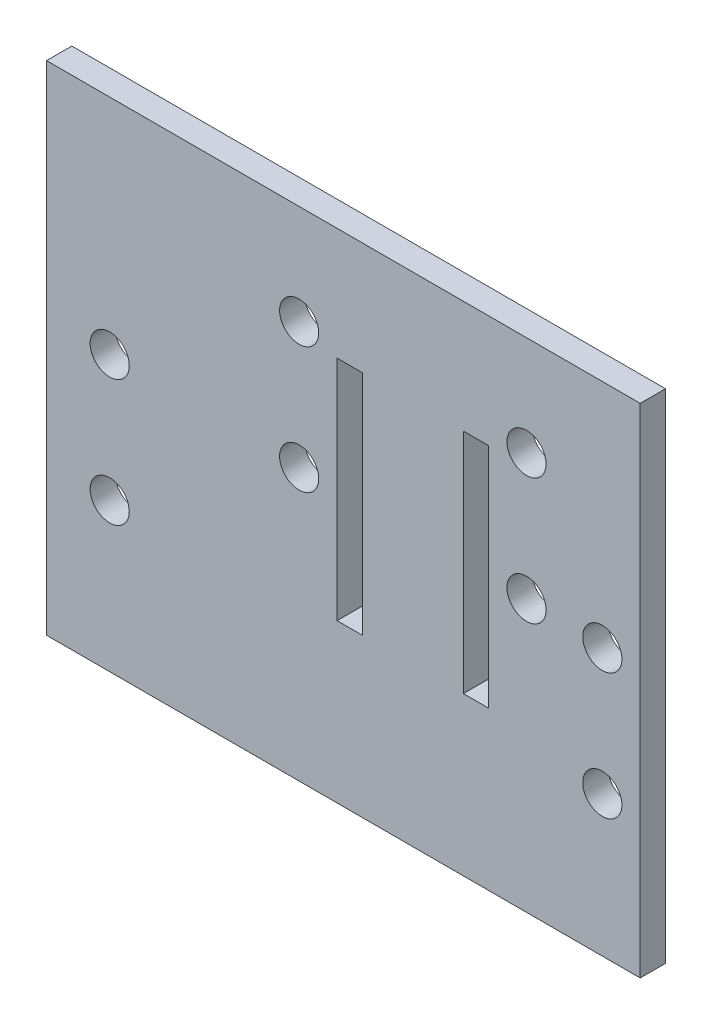
ISO-10303-21;
HEADER;
FILE_DESCRIPTION(('STEP AP214'),'2;1');
FILE_NAME('part.step','',(''),(''),'','','');
FILE_SCHEMA(('AUTOMOTIVE_DESIGN { 1 0 10303 214 1 1 1 1 }'));
ENDSEC;
DATA;
#1=APPLICATION_CONTEXT('core data for automotive mechanical design processes');
#2=APPLICATION_PROTOCOL_DEFINITION('international standard','automotive_design',2000,#1);
#3=PRODUCT_CONTEXT('',#1,'mechanical');
#4=PRODUCT('Part','Part','',(#3));
#5=PRODUCT_RELATED_PRODUCT_CATEGORY('part','',(#4));
#6=PRODUCT_DEFINITION_FORMATION('','',#4);
#7=PRODUCT_DEFINITION_CONTEXT('part definition',#1,'design');
#8=PRODUCT_DEFINITION('design','',#6,#7);
#9=PRODUCT_DEFINITION_SHAPE('','',#8);
#10=(LENGTH_UNIT() NAMED_UNIT(*) SI_UNIT(.MILLI.,.METRE.));
#11=(NAMED_UNIT(*) PLANE_ANGLE_UNIT() SI_UNIT($,.RADIAN.));
#12=(NAMED_UNIT(*) SI_UNIT($,.STERADIAN.) SOLID_ANGLE_UNIT());
#13=UNCERTAINTY_MEASURE_WITH_UNIT(LENGTH_MEASURE(1.E-05),#10,'distance_accuracy_value','');
#14=(GEOMETRIC_REPRESENTATION_CONTEXT(3) GLOBAL_UNCERTAINTY_ASSIGNED_CONTEXT((#13)) GLOBAL_UNIT_ASSIGNED_CONTEXT((#10,
#11,#12)) REPRESENTATION_CONTEXT('',''));
#15=CARTESIAN_POINT('',(0.,0.,0.));
#16=DIRECTION('',(0.,0.,1.));
#17=DIRECTION('',(1.,0.,0.));
#18=AXIS2_PLACEMENT_3D('',#15,#16,#17);
#19=CARTESIAN_POINT('',(0.,0.,2.));
#20=DIRECTION('',(0.,0.,1.));
#21=DIRECTION('',(1.,0.,0.));
#22=AXIS2_PLACEMENT_3D('',#19,#20,#21);
#23=PLANE('',#22);
#24=CARTESIAN_POINT('',(14.5,1.80000000000001,2.));
#25=DIRECTION('',(0.,0.,1.));
#26=DIRECTION('',(1.,0.,0.));
#27=AXIS2_PLACEMENT_3D('',#24,#25,#26);
#28=CIRCLE('',#27,1.55);
#29=CARTESIAN_POINT('',(16.05,1.80000000000001,2.));
#30=VERTEX_POINT('',#29);
#31=EDGE_CURVE('E380',#30,#30,#28,.T.);
#32=ORIENTED_EDGE('',*,*,#31,.F.);
#33=EDGE_LOOP('',(#32));
#34=FACE_BOUND('',#33,.T.);
#35=CARTESIAN_POINT('',(-3.49999960127017,11.8,2.));
#36=DIRECTION('',(0.,0.,1.));
#37=DIRECTION('',(1.,0.,0.));
#38=AXIS2_PLACEMENT_3D('',#35,#36,#37);
#39=CIRCLE('',#38,1.55);
#40=CARTESIAN_POINT('',(-1.94999960127017,11.8,2.));
#41=VERTEX_POINT('',#40);
#42=EDGE_CURVE('E168',#41,#41,#39,.T.);
#43=ORIENTED_EDGE('',*,*,#42,.F.);
#44=EDGE_LOOP('',(#43));
#45=FACE_BOUND('',#44,.T.);
#46=CARTESIAN_POINT('',(-18.5,2.05000000000001,2.));
#47=DIRECTION('',(0.,0.,1.));
#48=DIRECTION('',(1.,0.,0.));
#49=AXIS2_PLACEMENT_3D('',#46,#47,#48);
#50=CIRCLE('',#49,1.55);
#51=CARTESIAN_POINT('',(-16.95,2.05000000000001,2.));
#52=VERTEX_POINT('',#51);
#53=EDGE_CURVE('E235',#52,#52,#50,.T.);
#54=ORIENTED_EDGE('',*,*,#53,.F.);
#55=EDGE_LOOP('',(#54));
#56=FACE_BOUND('',#55,.T.);
#57=CARTESIAN_POINT('',(20.5,1.43,2.));
#58=DIRECTION('',(0.,0.,1.));
#59=DIRECTION('',(1.,0.,0.));
#60=AXIS2_PLACEMENT_3D('',#57,#58,#59);
#61=CIRCLE('',#60,1.55);
#62=CARTESIAN_POINT('',(22.05,1.43,2.));
#63=VERTEX_POINT('',#62);
#64=EDGE_CURVE('E251',#63,#63,#61,.T.);
#65=ORIENTED_EDGE('',*,*,#64,.F.);
#66=EDGE_LOOP('',(#65));
#67=FACE_BOUND('',#66,.T.);
#68=DIRECTION('',(0.,1.,0.));
#69=VECTOR('',#68,1.);
#70=CARTESIAN_POINT('',(23.5,19.7,2.));
#71=LINE('',#70,#69);
#72=CARTESIAN_POINT('',(23.5,-19.7,2.));
#73=VERTEX_POINT('',#72);
#74=CARTESIAN_POINT('',(23.5,19.7,2.));
#75=VERTEX_POINT('',#74);
#76=EDGE_CURVE('E259',#73,#75,#71,.T.);
#77=ORIENTED_EDGE('',*,*,#76,.T.);
#78=DIRECTION('',(-1.,0.,0.));
#79=VECTOR('',#78,1.);
#80=CARTESIAN_POINT('',(-23.5,19.7,2.));
#81=LINE('',#80,#79);
#82=CARTESIAN_POINT('',(-23.5,19.7,2.));
#83=VERTEX_POINT('',#82);
#84=EDGE_CURVE('E263',#75,#83,#81,.T.);
#85=ORIENTED_EDGE('',*,*,#84,.T.);
#86=DIRECTION('',(0.,-1.,0.));
#87=VECTOR('',#86,1.);
#88=CARTESIAN_POINT('',(-23.5,19.7,2.));
#89=LINE('',#88,#87);
#90=CARTESIAN_POINT('',(-23.5,-19.7,2.));
#91=VERTEX_POINT('',#90);
#92=EDGE_CURVE('E267',#83,#91,#89,.T.);
#93=ORIENTED_EDGE('',*,*,#92,.T.);
#94=DIRECTION('',(1.,0.,0.));
#95=VECTOR('',#94,1.);
#96=CARTESIAN_POINT('',(-23.5,-19.7,2.));
#97=LINE('',#96,#95);
#98=EDGE_CURVE('E270',#91,#73,#97,.T.);
#99=ORIENTED_EDGE('',*,*,#98,.T.);
#100=EDGE_LOOP('',(#77,#85,#93,#99));
#101=FACE_BOUND('',#100,.T.);
#102=CARTESIAN_POINT('',(20.5,-8.57,2.));
#103=DIRECTION('',(0.,0.,1.));
#104=DIRECTION('',(1.,0.,0.));
#105=AXIS2_PLACEMENT_3D('',#102,#103,#104);
#106=CIRCLE('',#105,1.55);
#107=CARTESIAN_POINT('',(22.05,-8.57,2.));
#108=VERTEX_POINT('',#107);
#109=EDGE_CURVE('E243',#108,#108,#106,.T.);
#110=ORIENTED_EDGE('',*,*,#109,.F.);
#111=EDGE_LOOP('',(#110));
#112=FACE_BOUND('',#111,.T.);
#113=CARTESIAN_POINT('',(-18.5,-7.94999999999999,2.));
#114=DIRECTION('',(0.,0.,1.));
#115=DIRECTION('',(1.,0.,0.));
#116=AXIS2_PLACEMENT_3D('',#113,#114,#115);
#117=CIRCLE('',#116,1.55);
#118=CARTESIAN_POINT('',(-16.95,-7.94999999999999,2.));
#119=VERTEX_POINT('',#118);
#120=EDGE_CURVE('E227',#119,#119,#117,.T.);
#121=ORIENTED_EDGE('',*,*,#120,.F.);
#122=EDGE_LOOP('',(#121));
#123=FACE_BOUND('',#122,.T.);
#124=DIRECTION('',(0.,-1.,0.));
#125=VECTOR('',#124,1.);
#126=CARTESIAN_POINT('',(9.49999999999999,-7.2,2.));
#127=LINE('',#126,#125);
#128=CARTESIAN_POINT('',(9.49999999999999,10.8,2.));
#129=VERTEX_POINT('',#128);
#130=CARTESIAN_POINT('',(9.49999999999999,-7.2,2.));
#131=VERTEX_POINT('',#130);
#132=EDGE_CURVE('E187',#129,#131,#127,.T.);
#133=ORIENTED_EDGE('',*,*,#132,.F.);
#134=DIRECTION('',(-1.,0.,0.));
#135=VECTOR('',#134,1.);
#136=CARTESIAN_POINT('',(9.49999999999999,10.8,2.));
#137=LINE('',#136,#135);
#138=CARTESIAN_POINT('',(11.5,10.8,2.));
#139=VERTEX_POINT('',#138);
#140=EDGE_CURVE('E184',#139,#129,#137,.T.);
#141=ORIENTED_EDGE('',*,*,#140,.F.);
#142=DIRECTION('',(0.,1.,0.));
#143=VECTOR('',#142,1.);
#144=CARTESIAN_POINT('',(11.5,10.8,2.));
#145=LINE('',#144,#143);
#146=CARTESIAN_POINT('',(11.5,-7.2,2.));
#147=VERTEX_POINT('',#146);
#148=EDGE_CURVE('E195',#147,#139,#145,.T.);
#149=ORIENTED_EDGE('',*,*,#148,.F.);
#150=DIRECTION('',(1.,0.,0.));
#151=VECTOR('',#150,1.);
#152=CARTESIAN_POINT('',(11.5,-7.2,2.));
#153=LINE('',#152,#151);
#154=EDGE_CURVE('E191',#131,#147,#153,.T.);
#155=ORIENTED_EDGE('',*,*,#154,.F.);
#156=EDGE_LOOP('',(#133,#141,#149,#155));
#157=FACE_BOUND('',#156,.T.);
#158=DIRECTION('',(0.,-1.,0.));
#159=VECTOR('',#158,1.);
#160=CARTESIAN_POINT('',(-0.500000000000014,-7.2,2.));
#161=LINE('',#160,#159);
#162=CARTESIAN_POINT('',(-0.500000000000014,10.8,2.));
#163=VERTEX_POINT('',#162);
#164=CARTESIAN_POINT('',(-0.500000000000014,-7.2,2.));
#165=VERTEX_POINT('',#164);
#166=EDGE_CURVE('E142',#163,#165,#161,.T.);
#167=ORIENTED_EDGE('',*,*,#166,.F.);
#168=DIRECTION('',(-1.,0.,0.));
#169=VECTOR('',#168,1.);
#170=CARTESIAN_POINT('',(-0.500000000000014,10.8,2.));
#171=LINE('',#170,#169);
#172=CARTESIAN_POINT('',(1.49999999999999,10.8,2.));
#173=VERTEX_POINT('',#172);
#174=EDGE_CURVE('E133',#173,#163,#171,.T.);
#175=ORIENTED_EDGE('',*,*,#174,.F.);
#176=DIRECTION('',(0.,1.,0.));
#177=VECTOR('',#176,1.);
#178=CARTESIAN_POINT('',(1.49999999999999,10.8,2.));
#179=LINE('',#178,#177);
#180=CARTESIAN_POINT('',(1.49999999999999,-7.2,2.));
#181=VERTEX_POINT('',#180);
#182=EDGE_CURVE('E160',#181,#173,#179,.T.);
#183=ORIENTED_EDGE('',*,*,#182,.F.);
#184=DIRECTION('',(1.,0.,0.));
#185=VECTOR('',#184,1.);
#186=CARTESIAN_POINT('',(1.49999999999999,-7.2,2.));
#187=LINE('',#186,#185);
#188=EDGE_CURVE('E156',#165,#181,#187,.T.);
#189=ORIENTED_EDGE('',*,*,#188,.F.);
#190=EDGE_LOOP('',(#167,#175,#183,#189));
#191=FACE_BOUND('',#190,.T.);
#192=CARTESIAN_POINT('',(-3.50000000000001,1.8,2.));
#193=DIRECTION('',(0.,0.,1.));
#194=DIRECTION('',(1.,0.,0.));
#195=AXIS2_PLACEMENT_3D('',#192,#193,#194);
#196=CIRCLE('',#195,1.55);
#197=CARTESIAN_POINT('',(-1.95000000000001,1.8,2.));
#198=VERTEX_POINT('',#197);
#199=EDGE_CURVE('E386',#198,#198,#196,.T.);
#200=ORIENTED_EDGE('',*,*,#199,.F.);
#201=EDGE_LOOP('',(#200));
#202=FACE_BOUND('',#201,.T.);
#203=CARTESIAN_POINT('',(14.5,11.8,2.));
#204=DIRECTION('',(0.,0.,1.));
#205=DIRECTION('',(1.,0.,0.));
#206=AXIS2_PLACEMENT_3D('',#203,#204,#205);
#207=CIRCLE('',#206,1.55);
#208=CARTESIAN_POINT('',(16.05,11.8,2.));
#209=VERTEX_POINT('',#208);
#210=EDGE_CURVE('E374',#209,#209,#207,.T.);
#211=ORIENTED_EDGE('',*,*,#210,.F.);
#212=EDGE_LOOP('',(#211));
#213=FACE_BOUND('',#212,.T.);
#214=ADVANCED_FACE('F43',(#34,#45,#56,#67,#101,#112,#123,#157,#191,#202,#213),#23,.T.);
#215=CARTESIAN_POINT('',(0.,0.,0.));
#216=DIRECTION('',(0.,0.,1.));
#217=DIRECTION('',(1.,0.,0.));
#218=AXIS2_PLACEMENT_3D('',#215,#216,#217);
#219=PLANE('',#218);
#220=DIRECTION('',(-1.,0.,0.));
#221=VECTOR('',#220,1.);
#222=CARTESIAN_POINT('',(9.49999999999999,10.8,0.));
#223=LINE('',#222,#221);
#224=CARTESIAN_POINT('',(11.5,10.8,0.));
#225=VERTEX_POINT('',#224);
#226=CARTESIAN_POINT('',(9.49999999999999,10.8,0.));
#227=VERTEX_POINT('',#226);
#228=EDGE_CURVE('E151',#225,#227,#223,.T.);
#229=ORIENTED_EDGE('',*,*,#228,.T.);
#230=DIRECTION('',(0.,-1.,0.));
#231=VECTOR('',#230,1.);
#232=CARTESIAN_POINT('',(9.49999999999999,-7.2,0.));
#233=LINE('',#232,#231);
#234=CARTESIAN_POINT('',(9.49999999999999,-7.2,0.));
#235=VERTEX_POINT('',#234);
#236=EDGE_CURVE('E202',#227,#235,#233,.T.);
#237=ORIENTED_EDGE('',*,*,#236,.T.);
#238=DIRECTION('',(1.,0.,0.));
#239=VECTOR('',#238,1.);
#240=CARTESIAN_POINT('',(11.5,-7.2,0.));
#241=LINE('',#240,#239);
#242=CARTESIAN_POINT('',(11.5,-7.2,0.));
#243=VERTEX_POINT('',#242);
#244=EDGE_CURVE('E206',#235,#243,#241,.T.);
#245=ORIENTED_EDGE('',*,*,#244,.T.);
#246=DIRECTION('',(0.,1.,0.));
#247=VECTOR('',#246,1.);
#248=CARTESIAN_POINT('',(11.5,10.8,0.));
#249=LINE('',#248,#247);
#250=EDGE_CURVE('E188',#243,#225,#249,.T.);
#251=ORIENTED_EDGE('',*,*,#250,.T.);
#252=EDGE_LOOP('',(#229,#237,#245,#251));
#253=FACE_BOUND('',#252,.T.);
#254=DIRECTION('',(0.,1.,0.));
#255=VECTOR('',#254,1.);
#256=CARTESIAN_POINT('',(23.5,19.7,0.));
#257=LINE('',#256,#255);
#258=CARTESIAN_POINT('',(23.5,-19.7,0.));
#259=VERTEX_POINT('',#258);
#260=CARTESIAN_POINT('',(23.5,19.7,0.));
#261=VERTEX_POINT('',#260);
#262=EDGE_CURVE('E255',#259,#261,#257,.T.);
#263=ORIENTED_EDGE('',*,*,#262,.F.);
#264=DIRECTION('',(1.,0.,0.));
#265=VECTOR('',#264,1.);
#266=CARTESIAN_POINT('',(-23.5,-19.7,0.));
#267=LINE('',#266,#265);
#268=CARTESIAN_POINT('',(-23.5,-19.7,0.));
#269=VERTEX_POINT('',#268);
#270=EDGE_CURVE('E264',#269,#259,#267,.T.);
#271=ORIENTED_EDGE('',*,*,#270,.F.);
#272=DIRECTION('',(0.,-1.,0.));
#273=VECTOR('',#272,1.);
#274=CARTESIAN_POINT('',(-23.5,19.7,0.));
#275=LINE('',#274,#273);
#276=CARTESIAN_POINT('',(-23.5,19.7,0.));
#277=VERTEX_POINT('',#276);
#278=EDGE_CURVE('E280',#277,#269,#275,.T.);
#279=ORIENTED_EDGE('',*,*,#278,.F.);
#280=DIRECTION('',(-1.,0.,0.));
#281=VECTOR('',#280,1.);
#282=CARTESIAN_POINT('',(-23.5,19.7,0.));
#283=LINE('',#282,#281);
#284=EDGE_CURVE('E277',#261,#277,#283,.T.);
#285=ORIENTED_EDGE('',*,*,#284,.F.);
#286=EDGE_LOOP('',(#263,#271,#279,#285));
#287=FACE_BOUND('',#286,.T.);
#288=CARTESIAN_POINT('',(20.5,1.43,0.));
#289=DIRECTION('',(0.,0.,1.));
#290=DIRECTION('',(1.,0.,0.));
#291=AXIS2_PLACEMENT_3D('',#288,#289,#290);
#292=CIRCLE('',#291,1.55);
#293=CARTESIAN_POINT('',(22.05,1.43,0.));
#294=VERTEX_POINT('',#293);
#295=EDGE_CURVE('E247',#294,#294,#292,.T.);
#296=ORIENTED_EDGE('',*,*,#295,.T.);
#297=EDGE_LOOP('',(#296));
#298=FACE_BOUND('',#297,.T.);
#299=CARTESIAN_POINT('',(20.5,-8.57,0.));
#300=DIRECTION('',(0.,0.,1.));
#301=DIRECTION('',(1.,0.,0.));
#302=AXIS2_PLACEMENT_3D('',#299,#300,#301);
#303=CIRCLE('',#302,1.55);
#304=CARTESIAN_POINT('',(22.05,-8.57,0.));
#305=VERTEX_POINT('',#304);
#306=EDGE_CURVE('E239',#305,#305,#303,.T.);
#307=ORIENTED_EDGE('',*,*,#306,.T.);
#308=EDGE_LOOP('',(#307));
#309=FACE_BOUND('',#308,.T.);
#310=CARTESIAN_POINT('',(-18.5,2.05000000000001,0.));
#311=DIRECTION('',(0.,0.,1.));
#312=DIRECTION('',(1.,0.,0.));
#313=AXIS2_PLACEMENT_3D('',#310,#311,#312);
#314=CIRCLE('',#313,1.55);
#315=CARTESIAN_POINT('',(-16.95,2.05000000000001,0.));
#316=VERTEX_POINT('',#315);
#317=EDGE_CURVE('E231',#316,#316,#314,.T.);
#318=ORIENTED_EDGE('',*,*,#317,.T.);
#319=EDGE_LOOP('',(#318));
#320=FACE_BOUND('',#319,.T.);
#321=CARTESIAN_POINT('',(-18.5,-7.94999999999999,0.));
#322=DIRECTION('',(0.,0.,1.));
#323=DIRECTION('',(1.,0.,0.));
#324=AXIS2_PLACEMENT_3D('',#321,#322,#323);
#325=CIRCLE('',#324,1.55);
#326=CARTESIAN_POINT('',(-16.95,-7.94999999999999,0.));
#327=VERTEX_POINT('',#326);
#328=EDGE_CURVE('E226',#327,#327,#325,.T.);
#329=ORIENTED_EDGE('',*,*,#328,.T.);
#330=EDGE_LOOP('',(#329));
#331=FACE_BOUND('',#330,.T.);
#332=DIRECTION('',(-1.,0.,0.));
#333=VECTOR('',#332,1.);
#334=CARTESIAN_POINT('',(-0.500000000000014,10.8,0.));
#335=LINE('',#334,#333);
#336=CARTESIAN_POINT('',(1.49999999999999,10.8,0.));
#337=VERTEX_POINT('',#336);
#338=CARTESIAN_POINT('',(-0.500000000000014,10.8,0.));
#339=VERTEX_POINT('',#338);
#340=EDGE_CURVE('E67',#337,#339,#335,.T.);
#341=ORIENTED_EDGE('',*,*,#340,.T.);
#342=DIRECTION('',(0.,-1.,0.));
#343=VECTOR('',#342,1.);
#344=CARTESIAN_POINT('',(-0.500000000000014,-7.2,0.));
#345=LINE('',#344,#343);
#346=CARTESIAN_POINT('',(-0.500000000000014,-7.2,0.));
#347=VERTEX_POINT('',#346);
#348=EDGE_CURVE('E149',#339,#347,#345,.T.);
#349=ORIENTED_EDGE('',*,*,#348,.T.);
#350=DIRECTION('',(1.,0.,0.));
#351=VECTOR('',#350,1.);
#352=CARTESIAN_POINT('',(1.49999999999999,-7.2,0.));
#353=LINE('',#352,#351);
#354=CARTESIAN_POINT('',(1.49999999999999,-7.2,0.));
#355=VERTEX_POINT('',#354);
#356=EDGE_CURVE('E171',#347,#355,#353,.T.);
#357=ORIENTED_EDGE('',*,*,#356,.T.);
#358=DIRECTION('',(0.,1.,0.));
#359=VECTOR('',#358,1.);
#360=CARTESIAN_POINT('',(1.49999999999999,10.8,0.));
#361=LINE('',#360,#359);
#362=EDGE_CURVE('E143',#355,#337,#361,.T.);
#363=ORIENTED_EDGE('',*,*,#362,.T.);
#364=EDGE_LOOP('',(#341,#349,#357,#363));
#365=FACE_BOUND('',#364,.T.);
#366=CARTESIAN_POINT('',(-3.49999960127017,11.8,0.));
#367=DIRECTION('',(0.,0.,1.));
#368=DIRECTION('',(1.,0.,0.));
#369=AXIS2_PLACEMENT_3D('',#366,#367,#368);
#370=CIRCLE('',#369,1.55);
#371=CARTESIAN_POINT('',(-1.94999960127017,11.8,0.));
#372=VERTEX_POINT('',#371);
#373=EDGE_CURVE('E360',#372,#372,#370,.T.);
#374=ORIENTED_EDGE('',*,*,#373,.T.);
#375=EDGE_LOOP('',(#374));
#376=FACE_BOUND('',#375,.T.);
#377=CARTESIAN_POINT('',(-3.50000000000001,1.8,0.));
#378=DIRECTION('',(0.,0.,1.));
#379=DIRECTION('',(1.,0.,0.));
#380=AXIS2_PLACEMENT_3D('',#377,#378,#379);
#381=CIRCLE('',#380,1.55);
#382=CARTESIAN_POINT('',(-1.95000000000001,1.8,0.));
#383=VERTEX_POINT('',#382);
#384=EDGE_CURVE('E364',#383,#383,#381,.T.);
#385=ORIENTED_EDGE('',*,*,#384,.T.);
#386=EDGE_LOOP('',(#385));
#387=FACE_BOUND('',#386,.T.);
#388=CARTESIAN_POINT('',(14.5,1.80000000000001,0.));
#389=DIRECTION('',(0.,0.,1.));
#390=DIRECTION('',(1.,0.,0.));
#391=AXIS2_PLACEMENT_3D('',#388,#389,#390);
#392=CIRCLE('',#391,1.55);
#393=CARTESIAN_POINT('',(16.05,1.80000000000001,0.));
#394=VERTEX_POINT('',#393);
#395=EDGE_CURVE('E368',#394,#394,#392,.T.);
#396=ORIENTED_EDGE('',*,*,#395,.T.);
#397=EDGE_LOOP('',(#396));
#398=FACE_BOUND('',#397,.T.);
#399=CARTESIAN_POINT('',(14.5,11.8,0.));
#400=DIRECTION('',(0.,0.,1.));
#401=DIRECTION('',(1.,0.,0.));
#402=AXIS2_PLACEMENT_3D('',#399,#400,#401);
#403=CIRCLE('',#402,1.55);
#404=CARTESIAN_POINT('',(16.05,11.8,0.));
#405=VERTEX_POINT('',#404);
#406=EDGE_CURVE('E371',#405,#405,#403,.T.);
#407=ORIENTED_EDGE('',*,*,#406,.T.);
#408=EDGE_LOOP('',(#407));
#409=FACE_BOUND('',#408,.T.);
#410=ADVANCED_FACE('F303',(#253,#287,#298,#309,#320,#331,#365,#376,#387,#398,#409),#219,.F.);
#411=CARTESIAN_POINT('',(23.5,19.7,2.));
#412=DIRECTION('',(-1.,0.,0.));
#413=DIRECTION('',(0.,-1.,0.));
#414=AXIS2_PLACEMENT_3D('',#411,#412,#413);
#415=PLANE('',#414);
#416=ORIENTED_EDGE('',*,*,#262,.T.);
#417=DIRECTION('',(0.,0.,-1.));
#418=VECTOR('',#417,1.);
#419=CARTESIAN_POINT('',(23.5,19.7,2.));
#420=LINE('',#419,#418);
#421=EDGE_CURVE('E11',#75,#261,#420,.T.);
#422=ORIENTED_EDGE('',*,*,#421,.F.);
#423=ORIENTED_EDGE('',*,*,#76,.F.);
#424=DIRECTION('',(0.,0.,-1.));
#425=VECTOR('',#424,1.);
#426=CARTESIAN_POINT('',(23.5,-19.7,2.));
#427=LINE('',#426,#425);
#428=EDGE_CURVE('E273',#73,#259,#427,.T.);
#429=ORIENTED_EDGE('',*,*,#428,.T.);
#430=EDGE_LOOP('',(#416,#422,#423,#429));
#431=FACE_BOUND('',#430,.T.);
#432=ADVANCED_FACE('F45',(#431),#415,.F.);
#433=CARTESIAN_POINT('',(-23.5,19.7,2.));
#434=DIRECTION('',(0.,-1.,0.));
#435=DIRECTION('',(0.,0.,-1.));
#436=AXIS2_PLACEMENT_3D('',#433,#434,#435);
#437=PLANE('',#436);
#438=ORIENTED_EDGE('',*,*,#284,.T.);
#439=DIRECTION('',(0.,0.,-1.));
#440=VECTOR('',#439,1.);
#441=CARTESIAN_POINT('',(-23.5,19.7,2.));
#442=LINE('',#441,#440);
#443=EDGE_CURVE('E52',#83,#277,#442,.T.);
#444=ORIENTED_EDGE('',*,*,#443,.F.);
#445=ORIENTED_EDGE('',*,*,#84,.F.);
#446=ORIENTED_EDGE('',*,*,#421,.T.);
#447=EDGE_LOOP('',(#438,#444,#445,#446));
#448=FACE_BOUND('',#447,.T.);
#449=ADVANCED_FACE('F314',(#448),#437,.F.);
#450=CARTESIAN_POINT('',(-23.5,19.7,2.));
#451=DIRECTION('',(1.,0.,0.));
#452=DIRECTION('',(0.,1.,0.));
#453=AXIS2_PLACEMENT_3D('',#450,#451,#452);
#454=PLANE('',#453);
#455=ORIENTED_EDGE('',*,*,#278,.T.);
#456=DIRECTION('',(0.,0.,-1.));
#457=VECTOR('',#456,1.);
#458=CARTESIAN_POINT('',(-23.5,-19.7,2.));
#459=LINE('',#458,#457);
#460=EDGE_CURVE('E288',#91,#269,#459,.T.);
#461=ORIENTED_EDGE('',*,*,#460,.F.);
#462=ORIENTED_EDGE('',*,*,#92,.F.);
#463=ORIENTED_EDGE('',*,*,#443,.T.);
#464=EDGE_LOOP('',(#455,#461,#462,#463));
#465=FACE_BOUND('',#464,.T.);
#466=ADVANCED_FACE('F297',(#465),#454,.F.);
#467=CARTESIAN_POINT('',(-23.5,-19.7,2.));
#468=DIRECTION('',(0.,1.,0.));
#469=DIRECTION('',(0.,0.,1.));
#470=AXIS2_PLACEMENT_3D('',#467,#468,#469);
#471=PLANE('',#470);
#472=ORIENTED_EDGE('',*,*,#270,.T.);
#473=ORIENTED_EDGE('',*,*,#428,.F.);
#474=ORIENTED_EDGE('',*,*,#98,.F.);
#475=ORIENTED_EDGE('',*,*,#460,.T.);
#476=EDGE_LOOP('',(#472,#473,#474,#475));
#477=FACE_BOUND('',#476,.T.);
#478=ADVANCED_FACE('F307',(#477),#471,.F.);
#479=CARTESIAN_POINT('',(20.5,1.43,2.));
#480=DIRECTION('',(0.,0.,-1.));
#481=DIRECTION('',(-1.,0.,0.));
#482=AXIS2_PLACEMENT_3D('',#479,#480,#481);
#483=CYLINDRICAL_SURFACE('',#482,1.55);
#484=ORIENTED_EDGE('',*,*,#64,.T.);
#485=EDGE_LOOP('',(#484));
#486=FACE_BOUND('',#485,.T.);
#487=ORIENTED_EDGE('',*,*,#295,.F.);
#488=EDGE_LOOP('',(#487));
#489=FACE_BOUND('',#488,.T.);
#490=ADVANCED_FACE('F332',(#486,#489),#483,.F.);
#491=CARTESIAN_POINT('',(20.5,-8.57,2.));
#492=DIRECTION('',(0.,0.,-1.));
#493=DIRECTION('',(-1.,0.,0.));
#494=AXIS2_PLACEMENT_3D('',#491,#492,#493);
#495=CYLINDRICAL_SURFACE('',#494,1.55);
#496=ORIENTED_EDGE('',*,*,#109,.T.);
#497=EDGE_LOOP('',(#496));
#498=FACE_BOUND('',#497,.T.);
#499=ORIENTED_EDGE('',*,*,#306,.F.);
#500=EDGE_LOOP('',(#499));
#501=FACE_BOUND('',#500,.T.);
#502=ADVANCED_FACE('F339',(#498,#501),#495,.F.);
#503=CARTESIAN_POINT('',(-18.5,2.05000000000001,2.));
#504=DIRECTION('',(0.,0.,-1.));
#505=DIRECTION('',(-1.,0.,0.));
#506=AXIS2_PLACEMENT_3D('',#503,#504,#505);
#507=CYLINDRICAL_SURFACE('',#506,1.55);
#508=ORIENTED_EDGE('',*,*,#53,.T.);
#509=EDGE_LOOP('',(#508));
#510=FACE_BOUND('',#509,.T.);
#511=ORIENTED_EDGE('',*,*,#317,.F.);
#512=EDGE_LOOP('',(#511));
#513=FACE_BOUND('',#512,.T.);
#514=ADVANCED_FACE('F344',(#510,#513),#507,.F.);
#515=CARTESIAN_POINT('',(-18.5,-7.94999999999999,2.));
#516=DIRECTION('',(0.,0.,-1.));
#517=DIRECTION('',(-1.,0.,0.));
#518=AXIS2_PLACEMENT_3D('',#515,#516,#517);
#519=CYLINDRICAL_SURFACE('',#518,1.55);
#520=ORIENTED_EDGE('',*,*,#120,.T.);
#521=EDGE_LOOP('',(#520));
#522=FACE_BOUND('',#521,.T.);
#523=ORIENTED_EDGE('',*,*,#328,.F.);
#524=EDGE_LOOP('',(#523));
#525=FACE_BOUND('',#524,.T.);
#526=ADVANCED_FACE('F405',(#522,#525),#519,.F.);
#527=CARTESIAN_POINT('',(9.49999999999999,10.8,2.));
#528=DIRECTION('',(0.,-1.,0.));
#529=DIRECTION('',(1.,0.,0.));
#530=AXIS2_PLACEMENT_3D('',#527,#528,#529);
#531=PLANE('',#530);
#532=ORIENTED_EDGE('',*,*,#228,.F.);
#533=DIRECTION('',(0.,0.,-1.));
#534=VECTOR('',#533,1.);
#535=CARTESIAN_POINT('',(11.5,10.8,2.));
#536=LINE('',#535,#534);
#537=EDGE_CURVE('E198',#139,#225,#536,.T.);
#538=ORIENTED_EDGE('',*,*,#537,.F.);
#539=ORIENTED_EDGE('',*,*,#140,.T.);
#540=DIRECTION('',(0.,0.,-1.));
#541=VECTOR('',#540,1.);
#542=CARTESIAN_POINT('',(9.49999999999999,10.8,2.));
#543=LINE('',#542,#541);
#544=EDGE_CURVE('E222',#129,#227,#543,.T.);
#545=ORIENTED_EDGE('',*,*,#544,.T.);
#546=EDGE_LOOP('',(#532,#538,#539,#545));
#547=FACE_BOUND('',#546,.T.);
#548=ADVANCED_FACE('F410',(#547),#531,.T.);
#549=CARTESIAN_POINT('',(9.49999999999999,-7.2,2.));
#550=DIRECTION('',(1.,0.,0.));
#551=DIRECTION('',(0.,1.,0.));
#552=AXIS2_PLACEMENT_3D('',#549,#550,#551);
#553=PLANE('',#552);
#554=ORIENTED_EDGE('',*,*,#236,.F.);
#555=ORIENTED_EDGE('',*,*,#544,.F.);
#556=ORIENTED_EDGE('',*,*,#132,.T.);
#557=DIRECTION('',(0.,0.,-1.));
#558=VECTOR('',#557,1.);
#559=CARTESIAN_POINT('',(9.49999999999999,-7.2,2.));
#560=LINE('',#559,#558);
#561=EDGE_CURVE('E219',#131,#235,#560,.T.);
#562=ORIENTED_EDGE('',*,*,#561,.T.);
#563=EDGE_LOOP('',(#554,#555,#556,#562));
#564=FACE_BOUND('',#563,.T.);
#565=ADVANCED_FACE('F416',(#564),#553,.T.);
#566=CARTESIAN_POINT('',(11.5,-7.2,2.));
#567=DIRECTION('',(0.,1.,0.));
#568=DIRECTION('',(0.,0.,1.));
#569=AXIS2_PLACEMENT_3D('',#566,#567,#568);
#570=PLANE('',#569);
#571=ORIENTED_EDGE('',*,*,#244,.F.);
#572=ORIENTED_EDGE('',*,*,#561,.F.);
#573=ORIENTED_EDGE('',*,*,#154,.T.);
#574=DIRECTION('',(0.,0.,-1.));
#575=VECTOR('',#574,1.);
#576=CARTESIAN_POINT('',(11.5,-7.2,2.));
#577=LINE('',#576,#575);
#578=EDGE_CURVE('E216',#147,#243,#577,.T.);
#579=ORIENTED_EDGE('',*,*,#578,.T.);
#580=EDGE_LOOP('',(#571,#572,#573,#579));
#581=FACE_BOUND('',#580,.T.);
#582=ADVANCED_FACE('F420',(#581),#570,.T.);
#583=CARTESIAN_POINT('',(11.5,10.8,2.));
#584=DIRECTION('',(-1.,0.,0.));
#585=DIRECTION('',(0.,-1.,0.));
#586=AXIS2_PLACEMENT_3D('',#583,#584,#585);
#587=PLANE('',#586);
#588=ORIENTED_EDGE('',*,*,#250,.F.);
#589=ORIENTED_EDGE('',*,*,#578,.F.);
#590=ORIENTED_EDGE('',*,*,#148,.T.);
#591=ORIENTED_EDGE('',*,*,#537,.T.);
#592=EDGE_LOOP('',(#588,#589,#590,#591));
#593=FACE_BOUND('',#592,.T.);
#594=ADVANCED_FACE('F424',(#593),#587,.T.);
#595=CARTESIAN_POINT('',(-0.500000000000014,10.8,2.));
#596=DIRECTION('',(0.,-1.,0.));
#597=DIRECTION('',(0.,0.,-1.));
#598=AXIS2_PLACEMENT_3D('',#595,#596,#597);
#599=PLANE('',#598);
#600=ORIENTED_EDGE('',*,*,#340,.F.);
#601=DIRECTION('',(0.,0.,-1.));
#602=VECTOR('',#601,1.);
#603=CARTESIAN_POINT('',(1.49999999999999,10.8,2.));
#604=LINE('',#603,#602);
#605=EDGE_CURVE('E137',#173,#337,#604,.T.);
#606=ORIENTED_EDGE('',*,*,#605,.F.);
#607=ORIENTED_EDGE('',*,*,#174,.T.);
#608=DIRECTION('',(0.,0.,-1.));
#609=VECTOR('',#608,1.);
#610=CARTESIAN_POINT('',(-0.500000000000014,10.8,2.));
#611=LINE('',#610,#609);
#612=EDGE_CURVE('E136',#163,#339,#611,.T.);
#613=ORIENTED_EDGE('',*,*,#612,.T.);
#614=EDGE_LOOP('',(#600,#606,#607,#613));
#615=FACE_BOUND('',#614,.T.);
#616=ADVANCED_FACE('F135',(#615),#599,.T.);
#617=CARTESIAN_POINT('',(-0.500000000000014,-7.2,2.));
#618=DIRECTION('',(1.,0.,0.));
#619=DIRECTION('',(0.,0.,-1.));
#620=AXIS2_PLACEMENT_3D('',#617,#618,#619);
#621=PLANE('',#620);
#622=ORIENTED_EDGE('',*,*,#348,.F.);
#623=ORIENTED_EDGE('',*,*,#612,.F.);
#624=ORIENTED_EDGE('',*,*,#166,.T.);
#625=DIRECTION('',(0.,0.,-1.));
#626=VECTOR('',#625,1.);
#627=CARTESIAN_POINT('',(-0.500000000000014,-7.2,2.));
#628=LINE('',#627,#626);
#629=EDGE_CURVE('E152',#165,#347,#628,.T.);
#630=ORIENTED_EDGE('',*,*,#629,.T.);
#631=EDGE_LOOP('',(#622,#623,#624,#630));
#632=FACE_BOUND('',#631,.T.);
#633=ADVANCED_FACE('F146',(#632),#621,.T.);
#634=CARTESIAN_POINT('',(1.49999999999999,-7.2,2.));
#635=DIRECTION('',(0.,1.,0.));
#636=DIRECTION('',(0.,0.,1.));
#637=AXIS2_PLACEMENT_3D('',#634,#635,#636);
#638=PLANE('',#637);
#639=ORIENTED_EDGE('',*,*,#356,.F.);
#640=ORIENTED_EDGE('',*,*,#629,.F.);
#641=ORIENTED_EDGE('',*,*,#188,.T.);
#642=DIRECTION('',(0.,0.,-1.));
#643=VECTOR('',#642,1.);
#644=CARTESIAN_POINT('',(1.49999999999999,-7.2,2.));
#645=LINE('',#644,#643);
#646=EDGE_CURVE('E59',#181,#355,#645,.T.);
#647=ORIENTED_EDGE('',*,*,#646,.T.);
#648=EDGE_LOOP('',(#639,#640,#641,#647));
#649=FACE_BOUND('',#648,.T.);
#650=ADVANCED_FACE('F433',(#649),#638,.T.);
#651=CARTESIAN_POINT('',(1.49999999999999,10.8,2.));
#652=DIRECTION('',(-1.,0.,0.));
#653=DIRECTION('',(0.,-1.,0.));
#654=AXIS2_PLACEMENT_3D('',#651,#652,#653);
#655=PLANE('',#654);
#656=ORIENTED_EDGE('',*,*,#362,.F.);
#657=ORIENTED_EDGE('',*,*,#646,.F.);
#658=ORIENTED_EDGE('',*,*,#182,.T.);
#659=ORIENTED_EDGE('',*,*,#605,.T.);
#660=EDGE_LOOP('',(#656,#657,#658,#659));
#661=FACE_BOUND('',#660,.T.);
#662=ADVANCED_FACE('F436',(#661),#655,.T.);
#663=CARTESIAN_POINT('',(-3.49999960127017,11.8,2.));
#664=DIRECTION('',(0.,0.,-1.));
#665=DIRECTION('',(-1.,0.,0.));
#666=AXIS2_PLACEMENT_3D('',#663,#664,#665);
#667=CYLINDRICAL_SURFACE('',#666,1.55);
#668=ORIENTED_EDGE('',*,*,#42,.T.);
#669=EDGE_LOOP('',(#668));
#670=FACE_BOUND('',#669,.T.);
#671=ORIENTED_EDGE('',*,*,#373,.F.);
#672=EDGE_LOOP('',(#671));
#673=FACE_BOUND('',#672,.T.);
#674=ADVANCED_FACE('F397',(#670,#673),#667,.F.);
#675=CARTESIAN_POINT('',(-3.50000000000001,1.8,2.));
#676=DIRECTION('',(0.,0.,-1.));
#677=DIRECTION('',(-1.,0.,0.));
#678=AXIS2_PLACEMENT_3D('',#675,#676,#677);
#679=CYLINDRICAL_SURFACE('',#678,1.55);
#680=ORIENTED_EDGE('',*,*,#199,.T.);
#681=EDGE_LOOP('',(#680));
#682=FACE_BOUND('',#681,.T.);
#683=ORIENTED_EDGE('',*,*,#384,.F.);
#684=EDGE_LOOP('',(#683));
#685=FACE_BOUND('',#684,.T.);
#686=ADVANCED_FACE('F442',(#682,#685),#679,.F.);
#687=CARTESIAN_POINT('',(14.5,1.80000000000001,2.));
#688=DIRECTION('',(0.,0.,-1.));
#689=DIRECTION('',(-1.,0.,0.));
#690=AXIS2_PLACEMENT_3D('',#687,#688,#689);
#691=CYLINDRICAL_SURFACE('',#690,1.55);
#692=ORIENTED_EDGE('',*,*,#31,.T.);
#693=EDGE_LOOP('',(#692));
#694=FACE_BOUND('',#693,.T.);
#695=ORIENTED_EDGE('',*,*,#395,.F.);
#696=EDGE_LOOP('',(#695));
#697=FACE_BOUND('',#696,.T.);
#698=ADVANCED_FACE('F445',(#694,#697),#691,.F.);
#699=CARTESIAN_POINT('',(14.5,11.8,2.));
#700=DIRECTION('',(0.,0.,-1.));
#701=DIRECTION('',(-1.,0.,0.));
#702=AXIS2_PLACEMENT_3D('',#699,#700,#701);
#703=CYLINDRICAL_SURFACE('',#702,1.55);
#704=ORIENTED_EDGE('',*,*,#210,.T.);
#705=EDGE_LOOP('',(#704));
#706=FACE_BOUND('',#705,.T.);
#707=ORIENTED_EDGE('',*,*,#406,.F.);
#708=EDGE_LOOP('',(#707));
#709=FACE_BOUND('',#708,.T.);
#710=ADVANCED_FACE('F449',(#706,#709),#703,.F.);
#711=CLOSED_SHELL('',(#214,#410,#432,#449,#466,#478,#490,#502,#514,#526,#548,#565,#582,#594,
#616,#633,#650,#662,#674,#686,#698,#710));
#712=MANIFOLD_SOLID_BREP('B2',#711);
#713=ADVANCED_BREP_SHAPE_REPRESENTATION('',(#18,#712),#14);
#714=SHAPE_DEFINITION_REPRESENTATION(#9,#713);
ENDSEC;
END-ISO-10303-21;
